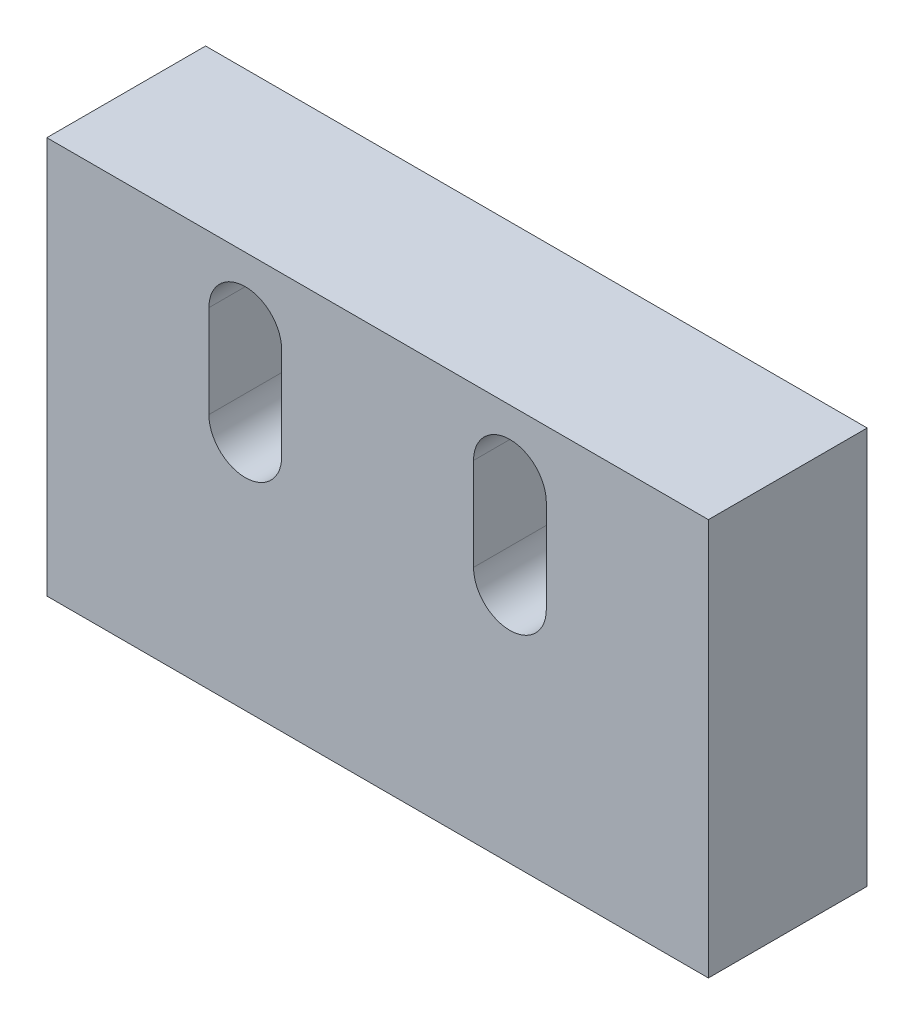
ISO-10303-21;
HEADER;
FILE_DESCRIPTION(('STEP AP214'),'2;1');
FILE_NAME('part.step','',(''),(''),'','','');
FILE_SCHEMA(('AUTOMOTIVE_DESIGN { 1 0 10303 214 1 1 1 1 }'));
ENDSEC;
DATA;
#1=APPLICATION_CONTEXT('core data for automotive mechanical design processes');
#2=APPLICATION_PROTOCOL_DEFINITION('international standard','automotive_design',2000,#1);
#3=PRODUCT_CONTEXT('',#1,'mechanical');
#4=PRODUCT('Part','Part','',(#3));
#5=PRODUCT_RELATED_PRODUCT_CATEGORY('part','',(#4));
#6=PRODUCT_DEFINITION_FORMATION('','',#4);
#7=PRODUCT_DEFINITION_CONTEXT('part definition',#1,'design');
#8=PRODUCT_DEFINITION('design','',#6,#7);
#9=PRODUCT_DEFINITION_SHAPE('','',#8);
#10=(LENGTH_UNIT() NAMED_UNIT(*) SI_UNIT(.MILLI.,.METRE.));
#11=(NAMED_UNIT(*) PLANE_ANGLE_UNIT() SI_UNIT($,.RADIAN.));
#12=(NAMED_UNIT(*) SI_UNIT($,.STERADIAN.) SOLID_ANGLE_UNIT());
#13=UNCERTAINTY_MEASURE_WITH_UNIT(LENGTH_MEASURE(1.E-05),#10,'distance_accuracy_value','');
#14=(GEOMETRIC_REPRESENTATION_CONTEXT(3) GLOBAL_UNCERTAINTY_ASSIGNED_CONTEXT((#13)) GLOBAL_UNIT_ASSIGNED_CONTEXT((#10,
#11,#12)) REPRESENTATION_CONTEXT('',''));
#15=CARTESIAN_POINT('',(0.,0.,0.));
#16=DIRECTION('',(0.,0.,1.));
#17=DIRECTION('',(1.,0.,0.));
#18=AXIS2_PLACEMENT_3D('',#15,#16,#17);
#19=CARTESIAN_POINT('',(25.,-15.,6.));
#20=DIRECTION('',(-1.,0.,0.));
#21=DIRECTION('',(0.,0.,1.));
#22=AXIS2_PLACEMENT_3D('',#19,#20,#21);
#23=PLANE('',#22);
#24=DIRECTION('',(0.,1.,0.));
#25=VECTOR('',#24,1.);
#26=CARTESIAN_POINT('',(25.,-15.,-6.));
#27=LINE('',#26,#25);
#28=CARTESIAN_POINT('',(25.,-15.,-6.));
#29=VERTEX_POINT('',#28);
#30=CARTESIAN_POINT('',(25.,15.,-6.));
#31=VERTEX_POINT('',#30);
#32=EDGE_CURVE('E360',#29,#31,#27,.T.);
#33=ORIENTED_EDGE('',*,*,#32,.T.);
#34=DIRECTION('',(0.,0.,-1.));
#35=VECTOR('',#34,1.);
#36=CARTESIAN_POINT('',(25.,15.,6.));
#37=LINE('',#36,#35);
#38=CARTESIAN_POINT('',(25.,15.,6.));
#39=VERTEX_POINT('',#38);
#40=EDGE_CURVE('E13',#39,#31,#37,.T.);
#41=ORIENTED_EDGE('',*,*,#40,.F.);
#42=DIRECTION('',(0.,1.,0.));
#43=VECTOR('',#42,1.);
#44=CARTESIAN_POINT('',(25.,-15.,6.));
#45=LINE('',#44,#43);
#46=CARTESIAN_POINT('',(25.,-15.,6.));
#47=VERTEX_POINT('',#46);
#48=EDGE_CURVE('E361',#47,#39,#45,.T.);
#49=ORIENTED_EDGE('',*,*,#48,.F.);
#50=DIRECTION('',(0.,0.,-1.));
#51=VECTOR('',#50,1.);
#52=CARTESIAN_POINT('',(25.,-15.,6.));
#53=LINE('',#52,#51);
#54=EDGE_CURVE('E371',#47,#29,#53,.T.);
#55=ORIENTED_EDGE('',*,*,#54,.T.);
#56=EDGE_LOOP('',(#33,#41,#49,#55));
#57=FACE_BOUND('',#56,.T.);
#58=ADVANCED_FACE('F187',(#57),#23,.F.);
#59=CARTESIAN_POINT('',(-25.,15.,6.));
#60=DIRECTION('',(0.,-1.,0.));
#61=DIRECTION('',(0.,0.,-1.));
#62=AXIS2_PLACEMENT_3D('',#59,#60,#61);
#63=PLANE('',#62);
#64=DIRECTION('',(-1.,0.,0.));
#65=VECTOR('',#64,1.);
#66=CARTESIAN_POINT('',(-25.,15.,-6.));
#67=LINE('',#66,#65);
#68=CARTESIAN_POINT('',(-25.,15.,-6.));
#69=VERTEX_POINT('',#68);
#70=EDGE_CURVE('E374',#31,#69,#67,.T.);
#71=ORIENTED_EDGE('',*,*,#70,.T.);
#72=DIRECTION('',(0.,0.,-1.));
#73=VECTOR('',#72,1.);
#74=CARTESIAN_POINT('',(-25.,15.,6.));
#75=LINE('',#74,#73);
#76=CARTESIAN_POINT('',(-25.,15.,6.));
#77=VERTEX_POINT('',#76);
#78=EDGE_CURVE('E194',#77,#69,#75,.T.);
#79=ORIENTED_EDGE('',*,*,#78,.F.);
#80=DIRECTION('',(-1.,0.,0.));
#81=VECTOR('',#80,1.);
#82=CARTESIAN_POINT('',(-25.,15.,6.));
#83=LINE('',#82,#81);
#84=EDGE_CURVE('E364',#39,#77,#83,.T.);
#85=ORIENTED_EDGE('',*,*,#84,.F.);
#86=ORIENTED_EDGE('',*,*,#40,.T.);
#87=EDGE_LOOP('',(#71,#79,#85,#86));
#88=FACE_BOUND('',#87,.T.);
#89=ADVANCED_FACE('F404',(#88),#63,.F.);
#90=CARTESIAN_POINT('',(-25.,-15.,6.));
#91=DIRECTION('',(1.,0.,0.));
#92=DIRECTION('',(0.,0.,-1.));
#93=AXIS2_PLACEMENT_3D('',#90,#91,#92);
#94=PLANE('',#93);
#95=DIRECTION('',(0.,-1.,0.));
#96=VECTOR('',#95,1.);
#97=CARTESIAN_POINT('',(-25.,-15.,-6.));
#98=LINE('',#97,#96);
#99=CARTESIAN_POINT('',(-25.,-15.,-6.));
#100=VERTEX_POINT('',#99);
#101=EDGE_CURVE('E376',#69,#100,#98,.T.);
#102=ORIENTED_EDGE('',*,*,#101,.T.);
#103=DIRECTION('',(0.,0.,-1.));
#104=VECTOR('',#103,1.);
#105=CARTESIAN_POINT('',(-25.,-15.,6.));
#106=LINE('',#105,#104);
#107=CARTESIAN_POINT('',(-25.,-15.,6.));
#108=VERTEX_POINT('',#107);
#109=EDGE_CURVE('E381',#108,#100,#106,.T.);
#110=ORIENTED_EDGE('',*,*,#109,.F.);
#111=DIRECTION('',(0.,-1.,0.));
#112=VECTOR('',#111,1.);
#113=CARTESIAN_POINT('',(-25.,-15.,6.));
#114=LINE('',#113,#112);
#115=EDGE_CURVE('E367',#77,#108,#114,.T.);
#116=ORIENTED_EDGE('',*,*,#115,.F.);
#117=ORIENTED_EDGE('',*,*,#78,.T.);
#118=EDGE_LOOP('',(#102,#110,#116,#117));
#119=FACE_BOUND('',#118,.T.);
#120=ADVANCED_FACE('F388',(#119),#94,.F.);
#121=CARTESIAN_POINT('',(-25.,-15.,6.));
#122=DIRECTION('',(0.,1.,0.));
#123=DIRECTION('',(0.,0.,1.));
#124=AXIS2_PLACEMENT_3D('',#121,#122,#123);
#125=PLANE('',#124);
#126=CARTESIAN_POINT('',(-15.,-15.,0.));
#127=DIRECTION('',(0.,-1.,0.));
#128=DIRECTION('',(0.,0.,-1.));
#129=AXIS2_PLACEMENT_3D('',#126,#127,#128);
#130=CIRCLE('',#129,2.09999999999999);
#131=CARTESIAN_POINT('',(-15.,-15.,-2.09999999999999));
#132=VERTEX_POINT('',#131);
#133=EDGE_CURVE('E293',#132,#132,#130,.T.);
#134=ORIENTED_EDGE('',*,*,#133,.F.);
#135=EDGE_LOOP('',(#134));
#136=FACE_BOUND('',#135,.T.);
#137=CARTESIAN_POINT('',(15.,-15.,0.));
#138=DIRECTION('',(0.,-1.,0.));
#139=DIRECTION('',(0.,0.,-1.));
#140=AXIS2_PLACEMENT_3D('',#137,#138,#139);
#141=CIRCLE('',#140,2.09999999999999);
#142=CARTESIAN_POINT('',(15.,-15.,-2.09999999999999));
#143=VERTEX_POINT('',#142);
#144=EDGE_CURVE('E292',#143,#143,#141,.T.);
#145=ORIENTED_EDGE('',*,*,#144,.F.);
#146=EDGE_LOOP('',(#145));
#147=FACE_BOUND('',#146,.T.);
#148=DIRECTION('',(1.,0.,0.));
#149=VECTOR('',#148,1.);
#150=CARTESIAN_POINT('',(-25.,-15.,-6.));
#151=LINE('',#150,#149);
#152=EDGE_CURVE('E365',#100,#29,#151,.T.);
#153=ORIENTED_EDGE('',*,*,#152,.T.);
#154=ORIENTED_EDGE('',*,*,#54,.F.);
#155=DIRECTION('',(1.,0.,0.));
#156=VECTOR('',#155,1.);
#157=CARTESIAN_POINT('',(-25.,-15.,6.));
#158=LINE('',#157,#156);
#159=EDGE_CURVE('E369',#108,#47,#158,.T.);
#160=ORIENTED_EDGE('',*,*,#159,.F.);
#161=ORIENTED_EDGE('',*,*,#109,.T.);
#162=EDGE_LOOP('',(#153,#154,#160,#161));
#163=FACE_BOUND('',#162,.T.);
#164=ADVANCED_FACE('F397',(#136,#147,#163),#125,.F.);
#165=CARTESIAN_POINT('',(0.,0.,6.));
#166=DIRECTION('',(0.,0.,-1.));
#167=DIRECTION('',(-1.,0.,0.));
#168=AXIS2_PLACEMENT_3D('',#165,#166,#167);
#169=PLANE('',#168);
#170=CARTESIAN_POINT('',(-10.,9.99999999999999,6.));
#171=DIRECTION('',(0.,0.,1.));
#172=DIRECTION('',(1.,0.,0.));
#173=AXIS2_PLACEMENT_3D('',#170,#171,#172);
#174=CIRCLE('',#173,2.75);
#175=CARTESIAN_POINT('',(-7.25,10.,6.));
#176=VERTEX_POINT('',#175);
#177=CARTESIAN_POINT('',(-12.75,10.,6.));
#178=VERTEX_POINT('',#177);
#179=EDGE_CURVE('E201',#176,#178,#174,.T.);
#180=ORIENTED_EDGE('',*,*,#179,.F.);
#181=DIRECTION('',(0.,-1.,0.));
#182=VECTOR('',#181,1.);
#183=CARTESIAN_POINT('',(-7.25,10.,6.));
#184=LINE('',#183,#182);
#185=CARTESIAN_POINT('',(-7.25,3.,6.));
#186=VERTEX_POINT('',#185);
#187=EDGE_CURVE('E311',#176,#186,#184,.T.);
#188=ORIENTED_EDGE('',*,*,#187,.T.);
#189=CARTESIAN_POINT('',(-10.,3.,6.));
#190=DIRECTION('',(0.,0.,1.));
#191=DIRECTION('',(1.,0.,0.));
#192=AXIS2_PLACEMENT_3D('',#189,#190,#191);
#193=CIRCLE('',#192,2.75);
#194=CARTESIAN_POINT('',(-12.75,3.,6.));
#195=VERTEX_POINT('',#194);
#196=EDGE_CURVE('E325',#195,#186,#193,.T.);
#197=ORIENTED_EDGE('',*,*,#196,.F.);
#198=DIRECTION('',(0.,-1.,0.));
#199=VECTOR('',#198,1.);
#200=CARTESIAN_POINT('',(-12.75,10.,6.));
#201=LINE('',#200,#199);
#202=EDGE_CURVE('E303',#178,#195,#201,.T.);
#203=ORIENTED_EDGE('',*,*,#202,.F.);
#204=EDGE_LOOP('',(#180,#188,#197,#203));
#205=FACE_BOUND('',#204,.T.);
#206=CARTESIAN_POINT('',(10.,9.99999999999999,6.));
#207=DIRECTION('',(0.,0.,1.));
#208=DIRECTION('',(1.,0.,0.));
#209=AXIS2_PLACEMENT_3D('',#206,#207,#208);
#210=CIRCLE('',#209,2.75);
#211=CARTESIAN_POINT('',(12.75,10.,6.));
#212=VERTEX_POINT('',#211);
#213=CARTESIAN_POINT('',(7.25,10.,6.));
#214=VERTEX_POINT('',#213);
#215=EDGE_CURVE('E343',#212,#214,#210,.T.);
#216=ORIENTED_EDGE('',*,*,#215,.F.);
#217=DIRECTION('',(0.,-1.,0.));
#218=VECTOR('',#217,1.);
#219=CARTESIAN_POINT('',(12.75,10.,6.));
#220=LINE('',#219,#218);
#221=CARTESIAN_POINT('',(12.75,3.,6.));
#222=VERTEX_POINT('',#221);
#223=EDGE_CURVE('E338',#212,#222,#220,.T.);
#224=ORIENTED_EDGE('',*,*,#223,.T.);
#225=CARTESIAN_POINT('',(10.,3.,6.));
#226=DIRECTION('',(0.,0.,1.));
#227=DIRECTION('',(1.,0.,0.));
#228=AXIS2_PLACEMENT_3D('',#225,#226,#227);
#229=CIRCLE('',#228,2.75);
#230=CARTESIAN_POINT('',(7.24999999999996,3.,6.));
#231=VERTEX_POINT('',#230);
#232=EDGE_CURVE('E353',#231,#222,#229,.T.);
#233=ORIENTED_EDGE('',*,*,#232,.F.);
#234=DIRECTION('',(0.,-1.,0.));
#235=VECTOR('',#234,1.);
#236=CARTESIAN_POINT('',(7.24999999999996,10.,6.));
#237=LINE('',#236,#235);
#238=EDGE_CURVE('E330',#214,#231,#237,.T.);
#239=ORIENTED_EDGE('',*,*,#238,.F.);
#240=EDGE_LOOP('',(#216,#224,#233,#239));
#241=FACE_BOUND('',#240,.T.);
#242=ORIENTED_EDGE('',*,*,#48,.T.);
#243=ORIENTED_EDGE('',*,*,#84,.T.);
#244=ORIENTED_EDGE('',*,*,#115,.T.);
#245=ORIENTED_EDGE('',*,*,#159,.T.);
#246=EDGE_LOOP('',(#242,#243,#244,#245));
#247=FACE_BOUND('',#246,.T.);
#248=ADVANCED_FACE('F403',(#205,#241,#247),#169,.F.);
#249=CARTESIAN_POINT('',(0.,0.,-6.));
#250=DIRECTION('',(0.,0.,-1.));
#251=DIRECTION('',(-1.,0.,0.));
#252=AXIS2_PLACEMENT_3D('',#249,#250,#251);
#253=PLANE('',#252);
#254=CARTESIAN_POINT('',(-10.,3.,-6.));
#255=DIRECTION('',(0.,0.,1.));
#256=DIRECTION('',(1.,0.,0.));
#257=AXIS2_PLACEMENT_3D('',#254,#255,#256);
#258=CIRCLE('',#257,2.75);
#259=CARTESIAN_POINT('',(-12.75,3.,-6.));
#260=VERTEX_POINT('',#259);
#261=CARTESIAN_POINT('',(-7.25,3.,-6.));
#262=VERTEX_POINT('',#261);
#263=EDGE_CURVE('E209',#260,#262,#258,.T.);
#264=ORIENTED_EDGE('',*,*,#263,.T.);
#265=DIRECTION('',(0.,-1.,0.));
#266=VECTOR('',#265,1.);
#267=CARTESIAN_POINT('',(-7.25,10.,-6.));
#268=LINE('',#267,#266);
#269=CARTESIAN_POINT('',(-7.25,10.,-6.));
#270=VERTEX_POINT('',#269);
#271=EDGE_CURVE('E308',#270,#262,#268,.T.);
#272=ORIENTED_EDGE('',*,*,#271,.F.);
#273=CARTESIAN_POINT('',(-10.,9.99999999999999,-6.));
#274=DIRECTION('',(0.,0.,1.));
#275=DIRECTION('',(1.,0.,0.));
#276=AXIS2_PLACEMENT_3D('',#273,#274,#275);
#277=CIRCLE('',#276,2.75);
#278=CARTESIAN_POINT('',(-12.75,10.,-6.));
#279=VERTEX_POINT('',#278);
#280=EDGE_CURVE('E318',#270,#279,#277,.T.);
#281=ORIENTED_EDGE('',*,*,#280,.T.);
#282=DIRECTION('',(0.,-1.,0.));
#283=VECTOR('',#282,1.);
#284=CARTESIAN_POINT('',(-12.75,10.,-6.));
#285=LINE('',#284,#283);
#286=EDGE_CURVE('E305',#279,#260,#285,.T.);
#287=ORIENTED_EDGE('',*,*,#286,.T.);
#288=EDGE_LOOP('',(#264,#272,#281,#287));
#289=FACE_BOUND('',#288,.T.);
#290=DIRECTION('',(0.,-1.,0.));
#291=VECTOR('',#290,1.);
#292=CARTESIAN_POINT('',(7.25,10.,-6.));
#293=LINE('',#292,#291);
#294=CARTESIAN_POINT('',(7.25,10.,-6.));
#295=VERTEX_POINT('',#294);
#296=CARTESIAN_POINT('',(7.25,3.,-6.));
#297=VERTEX_POINT('',#296);
#298=EDGE_CURVE('E332',#295,#297,#293,.T.);
#299=ORIENTED_EDGE('',*,*,#298,.T.);
#300=CARTESIAN_POINT('',(10.,3.,-6.));
#301=DIRECTION('',(0.,0.,1.));
#302=DIRECTION('',(1.,0.,0.));
#303=AXIS2_PLACEMENT_3D('',#300,#301,#302);
#304=CIRCLE('',#303,2.75);
#305=CARTESIAN_POINT('',(12.75,3.,-6.));
#306=VERTEX_POINT('',#305);
#307=EDGE_CURVE('E355',#297,#306,#304,.T.);
#308=ORIENTED_EDGE('',*,*,#307,.T.);
#309=DIRECTION('',(0.,-1.,0.));
#310=VECTOR('',#309,1.);
#311=CARTESIAN_POINT('',(12.75,10.,-6.));
#312=LINE('',#311,#310);
#313=CARTESIAN_POINT('',(12.75,10.,-6.));
#314=VERTEX_POINT('',#313);
#315=EDGE_CURVE('E335',#314,#306,#312,.T.);
#316=ORIENTED_EDGE('',*,*,#315,.F.);
#317=CARTESIAN_POINT('',(10.,9.99999999999999,-6.));
#318=DIRECTION('',(0.,0.,1.));
#319=DIRECTION('',(1.,0.,0.));
#320=AXIS2_PLACEMENT_3D('',#317,#318,#319);
#321=CIRCLE('',#320,2.75);
#322=EDGE_CURVE('E345',#314,#295,#321,.T.);
#323=ORIENTED_EDGE('',*,*,#322,.T.);
#324=EDGE_LOOP('',(#299,#308,#316,#323));
#325=FACE_BOUND('',#324,.T.);
#326=ORIENTED_EDGE('',*,*,#32,.F.);
#327=ORIENTED_EDGE('',*,*,#152,.F.);
#328=ORIENTED_EDGE('',*,*,#101,.F.);
#329=ORIENTED_EDGE('',*,*,#70,.F.);
#330=EDGE_LOOP('',(#326,#327,#328,#329));
#331=FACE_BOUND('',#330,.T.);
#332=ADVANCED_FACE('F394',(#289,#325,#331),#253,.T.);
#333=CARTESIAN_POINT('',(10.,3.,6.));
#334=DIRECTION('',(0.,0.,1.));
#335=DIRECTION('',(1.,0.,0.));
#336=AXIS2_PLACEMENT_3D('',#333,#334,#335);
#337=CYLINDRICAL_SURFACE('',#336,2.75);
#338=ORIENTED_EDGE('',*,*,#232,.T.);
#339=DIRECTION('',(0.,0.,-1.));
#340=VECTOR('',#339,1.);
#341=CARTESIAN_POINT('',(12.75,3.,-6.));
#342=LINE('',#341,#340);
#343=EDGE_CURVE('E351',#222,#306,#342,.T.);
#344=ORIENTED_EDGE('',*,*,#343,.T.);
#345=ORIENTED_EDGE('',*,*,#307,.F.);
#346=DIRECTION('',(0.,0.,1.));
#347=VECTOR('',#346,1.);
#348=CARTESIAN_POINT('',(7.25,3.,6.));
#349=LINE('',#348,#347);
#350=EDGE_CURVE('E358',#231,#297,#349,.F.);
#351=ORIENTED_EDGE('',*,*,#350,.F.);
#352=EDGE_LOOP('',(#338,#344,#345,#351));
#353=FACE_BOUND('',#352,.T.);
#354=ADVANCED_FACE('F417',(#353),#337,.F.);
#355=CARTESIAN_POINT('',(10.,9.99999999999999,6.));
#356=DIRECTION('',(0.,0.,1.));
#357=DIRECTION('',(1.,0.,0.));
#358=AXIS2_PLACEMENT_3D('',#355,#356,#357);
#359=CYLINDRICAL_SURFACE('',#358,2.75);
#360=ORIENTED_EDGE('',*,*,#322,.F.);
#361=DIRECTION('',(0.,0.,-1.));
#362=VECTOR('',#361,1.);
#363=CARTESIAN_POINT('',(12.75,9.99999999999999,-6.));
#364=LINE('',#363,#362);
#365=EDGE_CURVE('E341',#212,#314,#364,.T.);
#366=ORIENTED_EDGE('',*,*,#365,.F.);
#367=ORIENTED_EDGE('',*,*,#215,.T.);
#368=DIRECTION('',(0.,0.,1.));
#369=VECTOR('',#368,1.);
#370=CARTESIAN_POINT('',(7.25,9.99999999999999,6.));
#371=LINE('',#370,#369);
#372=EDGE_CURVE('E348',#295,#214,#371,.T.);
#373=ORIENTED_EDGE('',*,*,#372,.F.);
#374=EDGE_LOOP('',(#360,#366,#367,#373));
#375=FACE_BOUND('',#374,.T.);
#376=ADVANCED_FACE('F424',(#375),#359,.F.);
#377=CARTESIAN_POINT('',(12.75,10.,-6.));
#378=DIRECTION('',(-1.,0.,0.));
#379=DIRECTION('',(0.,0.,1.));
#380=AXIS2_PLACEMENT_3D('',#377,#378,#379);
#381=PLANE('',#380);
#382=ORIENTED_EDGE('',*,*,#343,.F.);
#383=ORIENTED_EDGE('',*,*,#223,.F.);
#384=ORIENTED_EDGE('',*,*,#365,.T.);
#385=ORIENTED_EDGE('',*,*,#315,.T.);
#386=EDGE_LOOP('',(#382,#383,#384,#385));
#387=FACE_BOUND('',#386,.T.);
#388=ADVANCED_FACE('F428',(#387),#381,.T.);
#389=CARTESIAN_POINT('',(7.25,10.,6.));
#390=DIRECTION('',(-1.,0.,0.));
#391=DIRECTION('',(0.,0.,1.));
#392=AXIS2_PLACEMENT_3D('',#389,#390,#391);
#393=PLANE('',#392);
#394=ORIENTED_EDGE('',*,*,#350,.T.);
#395=ORIENTED_EDGE('',*,*,#298,.F.);
#396=ORIENTED_EDGE('',*,*,#372,.T.);
#397=ORIENTED_EDGE('',*,*,#238,.T.);
#398=EDGE_LOOP('',(#394,#395,#396,#397));
#399=FACE_BOUND('',#398,.T.);
#400=ADVANCED_FACE('F432',(#399),#393,.F.);
#401=CARTESIAN_POINT('',(-10.,3.,6.));
#402=DIRECTION('',(0.,0.,1.));
#403=DIRECTION('',(1.,0.,0.));
#404=AXIS2_PLACEMENT_3D('',#401,#402,#403);
#405=CYLINDRICAL_SURFACE('',#404,2.75);
#406=ORIENTED_EDGE('',*,*,#196,.T.);
#407=DIRECTION('',(0.,0.,-1.));
#408=VECTOR('',#407,1.);
#409=CARTESIAN_POINT('',(-7.25,3.,-6.));
#410=LINE('',#409,#408);
#411=EDGE_CURVE('E323',#186,#262,#410,.T.);
#412=ORIENTED_EDGE('',*,*,#411,.T.);
#413=ORIENTED_EDGE('',*,*,#263,.F.);
#414=DIRECTION('',(0.,0.,1.));
#415=VECTOR('',#414,1.);
#416=CARTESIAN_POINT('',(-12.75,3.,6.));
#417=LINE('',#416,#415);
#418=EDGE_CURVE('E328',#195,#260,#417,.F.);
#419=ORIENTED_EDGE('',*,*,#418,.F.);
#420=EDGE_LOOP('',(#406,#412,#413,#419));
#421=FACE_BOUND('',#420,.T.);
#422=ADVANCED_FACE('F436',(#421),#405,.F.);
#423=CARTESIAN_POINT('',(-10.,9.99999999999999,6.));
#424=DIRECTION('',(0.,0.,1.));
#425=DIRECTION('',(1.,0.,0.));
#426=AXIS2_PLACEMENT_3D('',#423,#424,#425);
#427=CYLINDRICAL_SURFACE('',#426,2.75);
#428=ORIENTED_EDGE('',*,*,#280,.F.);
#429=DIRECTION('',(0.,0.,-1.));
#430=VECTOR('',#429,1.);
#431=CARTESIAN_POINT('',(-7.25,9.99999999999999,-6.));
#432=LINE('',#431,#430);
#433=EDGE_CURVE('E314',#176,#270,#432,.T.);
#434=ORIENTED_EDGE('',*,*,#433,.F.);
#435=ORIENTED_EDGE('',*,*,#179,.T.);
#436=DIRECTION('',(0.,0.,1.));
#437=VECTOR('',#436,1.);
#438=CARTESIAN_POINT('',(-12.75,9.99999999999999,6.));
#439=LINE('',#438,#437);
#440=EDGE_CURVE('E321',#279,#178,#439,.T.);
#441=ORIENTED_EDGE('',*,*,#440,.F.);
#442=EDGE_LOOP('',(#428,#434,#435,#441));
#443=FACE_BOUND('',#442,.T.);
#444=ADVANCED_FACE('F440',(#443),#427,.F.);
#445=CARTESIAN_POINT('',(-7.25,10.,-6.));
#446=DIRECTION('',(-1.,0.,0.));
#447=DIRECTION('',(0.,0.,1.));
#448=AXIS2_PLACEMENT_3D('',#445,#446,#447);
#449=PLANE('',#448);
#450=ORIENTED_EDGE('',*,*,#411,.F.);
#451=ORIENTED_EDGE('',*,*,#187,.F.);
#452=ORIENTED_EDGE('',*,*,#433,.T.);
#453=ORIENTED_EDGE('',*,*,#271,.T.);
#454=EDGE_LOOP('',(#450,#451,#452,#453));
#455=FACE_BOUND('',#454,.T.);
#456=ADVANCED_FACE('F443',(#455),#449,.T.);
#457=CARTESIAN_POINT('',(-12.75,10.,6.));
#458=DIRECTION('',(-1.,0.,0.));
#459=DIRECTION('',(0.,0.,1.));
#460=AXIS2_PLACEMENT_3D('',#457,#458,#459);
#461=PLANE('',#460);
#462=ORIENTED_EDGE('',*,*,#418,.T.);
#463=ORIENTED_EDGE('',*,*,#286,.F.);
#464=ORIENTED_EDGE('',*,*,#440,.T.);
#465=ORIENTED_EDGE('',*,*,#202,.T.);
#466=EDGE_LOOP('',(#462,#463,#464,#465));
#467=FACE_BOUND('',#466,.T.);
#468=ADVANCED_FACE('F446',(#467),#461,.F.);
#469=CARTESIAN_POINT('',(15.,-7.86180729995788,0.));
#470=DIRECTION('',(0.,-1.,0.));
#471=DIRECTION('',(0.,0.,-1.));
#472=AXIS2_PLACEMENT_3D('',#469,#470,#471);
#473=CONICAL_SURFACE('',#472,2.1,1.02974425867665);
#474=CARTESIAN_POINT('',(15.,-6.6,0.));
#475=VERTEX_POINT('',#474);
#476=VERTEX_LOOP('',#475);
#477=FACE_BOUND('',#476,.T.);
#478=CARTESIAN_POINT('',(15.,-7.86180729995788,0.));
#479=DIRECTION('',(0.,-1.,0.));
#480=DIRECTION('',(0.,0.,-1.));
#481=AXIS2_PLACEMENT_3D('',#478,#479,#480);
#482=CIRCLE('',#481,2.1);
#483=CARTESIAN_POINT('',(15.,-7.86180729995788,-2.1));
#484=VERTEX_POINT('',#483);
#485=EDGE_CURVE('E296',#484,#484,#482,.T.);
#486=ORIENTED_EDGE('',*,*,#485,.T.);
#487=EDGE_LOOP('',(#486));
#488=FACE_BOUND('',#487,.T.);
#489=ADVANCED_FACE('F450',(#477,#488),#473,.F.);
#490=CARTESIAN_POINT('',(15.,-15.,0.));
#491=DIRECTION('',(0.,-1.,0.));
#492=DIRECTION('',(0.,0.,-1.));
#493=AXIS2_PLACEMENT_3D('',#490,#491,#492);
#494=CYLINDRICAL_SURFACE('',#493,2.09999999999999);
#495=ORIENTED_EDGE('',*,*,#485,.F.);
#496=EDGE_LOOP('',(#495));
#497=FACE_BOUND('',#496,.T.);
#498=ORIENTED_EDGE('',*,*,#144,.T.);
#499=EDGE_LOOP('',(#498));
#500=FACE_BOUND('',#499,.T.);
#501=ADVANCED_FACE('F286',(#497,#500),#494,.F.);
#502=CARTESIAN_POINT('',(-15.,-7.86180729995788,0.));
#503=DIRECTION('',(0.,-1.,0.));
#504=DIRECTION('',(0.,0.,-1.));
#505=AXIS2_PLACEMENT_3D('',#502,#503,#504);
#506=CONICAL_SURFACE('',#505,2.1,1.02974425867665);
#507=CARTESIAN_POINT('',(-15.,-6.6,0.));
#508=VERTEX_POINT('',#507);
#509=VERTEX_LOOP('',#508);
#510=FACE_BOUND('',#509,.T.);
#511=CARTESIAN_POINT('',(-15.,-7.86180729995788,0.));
#512=DIRECTION('',(0.,-1.,0.));
#513=DIRECTION('',(0.,0.,-1.));
#514=AXIS2_PLACEMENT_3D('',#511,#512,#513);
#515=CIRCLE('',#514,2.1);
#516=CARTESIAN_POINT('',(-15.,-7.86180729995788,-2.1));
#517=VERTEX_POINT('',#516);
#518=EDGE_CURVE('E290',#517,#517,#515,.T.);
#519=ORIENTED_EDGE('',*,*,#518,.T.);
#520=EDGE_LOOP('',(#519));
#521=FACE_BOUND('',#520,.T.);
#522=ADVANCED_FACE('F282',(#510,#521),#506,.F.);
#523=CARTESIAN_POINT('',(-15.,-15.,0.));
#524=DIRECTION('',(0.,-1.,0.));
#525=DIRECTION('',(0.,0.,-1.));
#526=AXIS2_PLACEMENT_3D('',#523,#524,#525);
#527=CYLINDRICAL_SURFACE('',#526,2.09999999999999);
#528=ORIENTED_EDGE('',*,*,#518,.F.);
#529=EDGE_LOOP('',(#528));
#530=FACE_BOUND('',#529,.T.);
#531=ORIENTED_EDGE('',*,*,#133,.T.);
#532=EDGE_LOOP('',(#531));
#533=FACE_BOUND('',#532,.T.);
#534=ADVANCED_FACE('F285',(#530,#533),#527,.F.);
#535=CLOSED_SHELL('',(#58,#89,#120,#164,#248,#332,#354,#376,#388,#400,#422,#444,#456,#468,#489,
#501,#522,#534));
#536=MANIFOLD_SOLID_BREP('B2',#535);
#537=ADVANCED_BREP_SHAPE_REPRESENTATION('',(#18,#536),#14);
#538=SHAPE_DEFINITION_REPRESENTATION(#9,#537);
ENDSEC;
END-ISO-10303-21;
